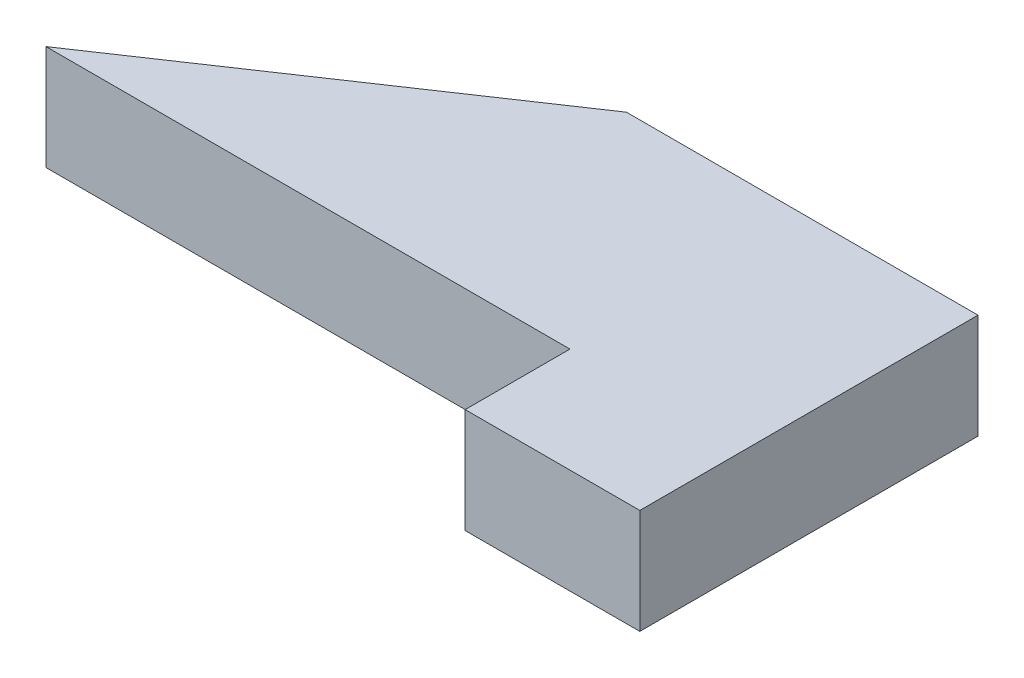
ISO-10303-21;
HEADER;
FILE_DESCRIPTION(('STEP AP214'),'2;1');
FILE_NAME('part.step','',(''),(''),'','','');
FILE_SCHEMA(('AUTOMOTIVE_DESIGN { 1 0 10303 214 1 1 1 1 }'));
ENDSEC;
DATA;
#1=APPLICATION_CONTEXT('core data for automotive mechanical design processes');
#2=APPLICATION_PROTOCOL_DEFINITION('international standard','automotive_design',2000,#1);
#3=PRODUCT_CONTEXT('',#1,'mechanical');
#4=PRODUCT('Part','Part','',(#3));
#5=PRODUCT_RELATED_PRODUCT_CATEGORY('part','',(#4));
#6=PRODUCT_DEFINITION_FORMATION('','',#4);
#7=PRODUCT_DEFINITION_CONTEXT('part definition',#1,'design');
#8=PRODUCT_DEFINITION('design','',#6,#7);
#9=PRODUCT_DEFINITION_SHAPE('','',#8);
#10=(LENGTH_UNIT() NAMED_UNIT(*) SI_UNIT(.MILLI.,.METRE.));
#11=(NAMED_UNIT(*) PLANE_ANGLE_UNIT() SI_UNIT($,.RADIAN.));
#12=(NAMED_UNIT(*) SI_UNIT($,.STERADIAN.) SOLID_ANGLE_UNIT());
#13=UNCERTAINTY_MEASURE_WITH_UNIT(LENGTH_MEASURE(1.E-05),#10,'distance_accuracy_value','');
#14=(GEOMETRIC_REPRESENTATION_CONTEXT(3) GLOBAL_UNCERTAINTY_ASSIGNED_CONTEXT((#13)) GLOBAL_UNIT_ASSIGNED_CONTEXT((#10,
#11,#12)) REPRESENTATION_CONTEXT('',''));
#15=CARTESIAN_POINT('',(0.,0.,0.));
#16=DIRECTION('',(0.,0.,1.));
#17=DIRECTION('',(1.,0.,0.));
#18=AXIS2_PLACEMENT_3D('',#15,#16,#17);
#19=CARTESIAN_POINT('',(-5.,3.,-3.));
#20=DIRECTION('',(0.,0.,1.));
#21=DIRECTION('',(1.,0.,0.));
#22=AXIS2_PLACEMENT_3D('',#19,#20,#21);
#23=PLANE('',#22);
#24=DIRECTION('',(-1.,0.,0.));
#25=VECTOR('',#24,1.);
#26=CARTESIAN_POINT('',(-5.,0.,-3.));
#27=LINE('',#26,#25);
#28=CARTESIAN_POINT('',(-5.,0.,-3.));
#29=VERTEX_POINT('',#28);
#30=CARTESIAN_POINT('',(-20.,0.,-3.));
#31=VERTEX_POINT('',#30);
#32=EDGE_CURVE('E117',#29,#31,#27,.T.);
#33=ORIENTED_EDGE('',*,*,#32,.F.);
#34=DIRECTION('',(0.,-1.,0.));
#35=VECTOR('',#34,1.);
#36=CARTESIAN_POINT('',(-5.,3.,-3.));
#37=LINE('',#36,#35);
#38=CARTESIAN_POINT('',(-5.,3.,-3.));
#39=VERTEX_POINT('',#38);
#40=EDGE_CURVE('E11',#39,#29,#37,.T.);
#41=ORIENTED_EDGE('',*,*,#40,.F.);
#42=DIRECTION('',(-1.,0.,0.));
#43=VECTOR('',#42,1.);
#44=CARTESIAN_POINT('',(-5.,3.,-3.));
#45=LINE('',#44,#43);
#46=CARTESIAN_POINT('',(-20.,3.,-3.));
#47=VERTEX_POINT('',#46);
#48=EDGE_CURVE('E131',#39,#47,#45,.T.);
#49=ORIENTED_EDGE('',*,*,#48,.T.);
#50=DIRECTION('',(0.,-1.,0.));
#51=VECTOR('',#50,1.);
#52=CARTESIAN_POINT('',(-20.,3.,-3.));
#53=LINE('',#52,#51);
#54=EDGE_CURVE('E37',#47,#31,#53,.T.);
#55=ORIENTED_EDGE('',*,*,#54,.T.);
#56=EDGE_LOOP('',(#33,#41,#49,#55));
#57=FACE_BOUND('',#56,.T.);
#58=ADVANCED_FACE('F34',(#57),#23,.T.);
#59=CARTESIAN_POINT('',(-5.,3.,0.));
#60=DIRECTION('',(-1.,0.,0.));
#61=DIRECTION('',(0.,0.,1.));
#62=AXIS2_PLACEMENT_3D('',#59,#60,#61);
#63=PLANE('',#62);
#64=DIRECTION('',(0.,0.,-1.));
#65=VECTOR('',#64,1.);
#66=CARTESIAN_POINT('',(-5.,0.,0.));
#67=LINE('',#66,#65);
#68=CARTESIAN_POINT('',(-5.,0.,0.));
#69=VERTEX_POINT('',#68);
#70=EDGE_CURVE('E129',#69,#29,#67,.T.);
#71=ORIENTED_EDGE('',*,*,#70,.F.);
#72=DIRECTION('',(0.,-1.,0.));
#73=VECTOR('',#72,1.);
#74=CARTESIAN_POINT('',(-5.,3.,0.));
#75=LINE('',#74,#73);
#76=CARTESIAN_POINT('',(-5.,3.,0.));
#77=VERTEX_POINT('',#76);
#78=EDGE_CURVE('E43',#77,#69,#75,.T.);
#79=ORIENTED_EDGE('',*,*,#78,.F.);
#80=DIRECTION('',(0.,0.,-1.));
#81=VECTOR('',#80,1.);
#82=CARTESIAN_POINT('',(-5.,3.,0.));
#83=LINE('',#82,#81);
#84=EDGE_CURVE('E112',#77,#39,#83,.T.);
#85=ORIENTED_EDGE('',*,*,#84,.T.);
#86=ORIENTED_EDGE('',*,*,#40,.T.);
#87=EDGE_LOOP('',(#71,#79,#85,#86));
#88=FACE_BOUND('',#87,.T.);
#89=ADVANCED_FACE('F139',(#88),#63,.T.);
#90=CARTESIAN_POINT('',(0.,3.,0.));
#91=DIRECTION('',(0.,0.,1.));
#92=DIRECTION('',(1.,0.,0.));
#93=AXIS2_PLACEMENT_3D('',#90,#91,#92);
#94=PLANE('',#93);
#95=DIRECTION('',(-1.,0.,0.));
#96=VECTOR('',#95,1.);
#97=CARTESIAN_POINT('',(0.,0.,0.));
#98=LINE('',#97,#96);
#99=CARTESIAN_POINT('',(0.,0.,0.));
#100=VERTEX_POINT('',#99);
#101=EDGE_CURVE('E109',#100,#69,#98,.T.);
#102=ORIENTED_EDGE('',*,*,#101,.F.);
#103=DIRECTION('',(0.,-1.,0.));
#104=VECTOR('',#103,1.);
#105=CARTESIAN_POINT('',(0.,3.,0.));
#106=LINE('',#105,#104);
#107=CARTESIAN_POINT('',(0.,3.,0.));
#108=VERTEX_POINT('',#107);
#109=EDGE_CURVE('E96',#108,#100,#106,.T.);
#110=ORIENTED_EDGE('',*,*,#109,.F.);
#111=DIRECTION('',(-1.,0.,0.));
#112=VECTOR('',#111,1.);
#113=CARTESIAN_POINT('',(0.,3.,0.));
#114=LINE('',#113,#112);
#115=EDGE_CURVE('E104',#108,#77,#114,.T.);
#116=ORIENTED_EDGE('',*,*,#115,.T.);
#117=ORIENTED_EDGE('',*,*,#78,.T.);
#118=EDGE_LOOP('',(#102,#110,#116,#117));
#119=FACE_BOUND('',#118,.T.);
#120=ADVANCED_FACE('F107',(#119),#94,.T.);
#121=CARTESIAN_POINT('',(0.,3.,0.));
#122=DIRECTION('',(-1.,0.,0.));
#123=DIRECTION('',(0.,0.,1.));
#124=AXIS2_PLACEMENT_3D('',#121,#122,#123);
#125=PLANE('',#124);
#126=DIRECTION('',(0.,0.,-1.));
#127=VECTOR('',#126,1.);
#128=CARTESIAN_POINT('',(0.,0.,0.));
#129=LINE('',#128,#127);
#130=CARTESIAN_POINT('',(0.,0.,-9.6820981422111));
#131=VERTEX_POINT('',#130);
#132=EDGE_CURVE('E126',#100,#131,#129,.T.);
#133=ORIENTED_EDGE('',*,*,#132,.T.);
#134=DIRECTION('',(0.,-1.,0.));
#135=VECTOR('',#134,1.);
#136=CARTESIAN_POINT('',(0.,3.,-9.6820981422111));
#137=LINE('',#136,#135);
#138=CARTESIAN_POINT('',(0.,3.,-9.6820981422111));
#139=VERTEX_POINT('',#138);
#140=EDGE_CURVE('E99',#139,#131,#137,.T.);
#141=ORIENTED_EDGE('',*,*,#140,.F.);
#142=DIRECTION('',(0.,0.,-1.));
#143=VECTOR('',#142,1.);
#144=CARTESIAN_POINT('',(0.,3.,-3.));
#145=LINE('',#144,#143);
#146=EDGE_CURVE('E93',#108,#139,#145,.T.);
#147=ORIENTED_EDGE('',*,*,#146,.F.);
#148=ORIENTED_EDGE('',*,*,#109,.T.);
#149=EDGE_LOOP('',(#133,#141,#147,#148));
#150=FACE_BOUND('',#149,.T.);
#151=ADVANCED_FACE('F95',(#150),#125,.F.);
#152=CARTESIAN_POINT('',(-10.0657879679471,3.,-9.6820981422111));
#153=DIRECTION('',(0.,0.,-1.));
#154=DIRECTION('',(-1.,0.,0.));
#155=AXIS2_PLACEMENT_3D('',#152,#153,#154);
#156=PLANE('',#155);
#157=DIRECTION('',(1.,0.,0.));
#158=VECTOR('',#157,1.);
#159=CARTESIAN_POINT('',(-10.0657879679471,0.,-9.6820981422111));
#160=LINE('',#159,#158);
#161=CARTESIAN_POINT('',(-10.0657879679471,0.,-9.6820981422111));
#162=VERTEX_POINT('',#161);
#163=EDGE_CURVE('E123',#162,#131,#160,.T.);
#164=ORIENTED_EDGE('',*,*,#163,.F.);
#165=DIRECTION('',(0.,-1.,0.));
#166=VECTOR('',#165,1.);
#167=CARTESIAN_POINT('',(-10.0657879679471,3.,-9.6820981422111));
#168=LINE('',#167,#166);
#169=CARTESIAN_POINT('',(-10.0657879679471,3.,-9.6820981422111));
#170=VERTEX_POINT('',#169);
#171=EDGE_CURVE('E134',#170,#162,#168,.T.);
#172=ORIENTED_EDGE('',*,*,#171,.F.);
#173=DIRECTION('',(1.,0.,0.));
#174=VECTOR('',#173,1.);
#175=CARTESIAN_POINT('',(-10.0657879679471,3.,-9.6820981422111));
#176=LINE('',#175,#174);
#177=EDGE_CURVE('E105',#170,#139,#176,.T.);
#178=ORIENTED_EDGE('',*,*,#177,.T.);
#179=ORIENTED_EDGE('',*,*,#140,.T.);
#180=EDGE_LOOP('',(#164,#172,#178,#179));
#181=FACE_BOUND('',#180,.T.);
#182=ADVANCED_FACE('F152',(#181),#156,.T.);
#183=CARTESIAN_POINT('',(-20.,3.,-3.));
#184=DIRECTION('',(-0.558123948905455,0.,-0.829757589696039));
#185=DIRECTION('',(-0.829757589696039,0.,0.558123948905456));
#186=AXIS2_PLACEMENT_3D('',#183,#184,#185);
#187=PLANE('',#186);
#188=DIRECTION('',(0.829757589696039,0.,-0.558123948905456));
#189=VECTOR('',#188,1.);
#190=CARTESIAN_POINT('',(-20.,0.,-3.));
#191=LINE('',#190,#189);
#192=EDGE_CURVE('E120',#31,#162,#191,.T.);
#193=ORIENTED_EDGE('',*,*,#192,.F.);
#194=ORIENTED_EDGE('',*,*,#54,.F.);
#195=DIRECTION('',(0.829757589696039,0.,-0.558123948905456));
#196=VECTOR('',#195,1.);
#197=CARTESIAN_POINT('',(-20.,3.,-3.));
#198=LINE('',#197,#196);
#199=EDGE_CURVE('E207',#47,#170,#198,.T.);
#200=ORIENTED_EDGE('',*,*,#199,.T.);
#201=ORIENTED_EDGE('',*,*,#171,.T.);
#202=EDGE_LOOP('',(#193,#194,#200,#201));
#203=FACE_BOUND('',#202,.T.);
#204=ADVANCED_FACE('F136',(#203),#187,.T.);
#205=CARTESIAN_POINT('',(0.,3.,0.));
#206=DIRECTION('',(0.,-1.,0.));
#207=DIRECTION('',(0.,0.,-1.));
#208=AXIS2_PLACEMENT_3D('',#205,#206,#207);
#209=PLANE('',#208);
#210=ORIENTED_EDGE('',*,*,#48,.F.);
#211=ORIENTED_EDGE('',*,*,#84,.F.);
#212=ORIENTED_EDGE('',*,*,#115,.F.);
#213=ORIENTED_EDGE('',*,*,#146,.T.);
#214=ORIENTED_EDGE('',*,*,#177,.F.);
#215=ORIENTED_EDGE('',*,*,#199,.F.);
#216=EDGE_LOOP('',(#210,#211,#212,#213,#214,#215));
#217=FACE_BOUND('',#216,.T.);
#218=ADVANCED_FACE('F111',(#217),#209,.F.);
#219=CARTESIAN_POINT('',(0.,0.,0.));
#220=DIRECTION('',(0.,-1.,0.));
#221=DIRECTION('',(0.,0.,-1.));
#222=AXIS2_PLACEMENT_3D('',#219,#220,#221);
#223=PLANE('',#222);
#224=ORIENTED_EDGE('',*,*,#32,.T.);
#225=ORIENTED_EDGE('',*,*,#192,.T.);
#226=ORIENTED_EDGE('',*,*,#163,.T.);
#227=ORIENTED_EDGE('',*,*,#132,.F.);
#228=ORIENTED_EDGE('',*,*,#101,.T.);
#229=ORIENTED_EDGE('',*,*,#70,.T.);
#230=EDGE_LOOP('',(#224,#225,#226,#227,#228,#229));
#231=FACE_BOUND('',#230,.T.);
#232=ADVANCED_FACE('F138',(#231),#223,.T.);
#233=CLOSED_SHELL('',(#58,#89,#120,#151,#182,#204,#218,#232));
#234=MANIFOLD_SOLID_BREP('B2',#233);
#235=ADVANCED_BREP_SHAPE_REPRESENTATION('',(#18,#234),#14);
#236=SHAPE_DEFINITION_REPRESENTATION(#9,#235);
ENDSEC;
END-ISO-10303-21;
